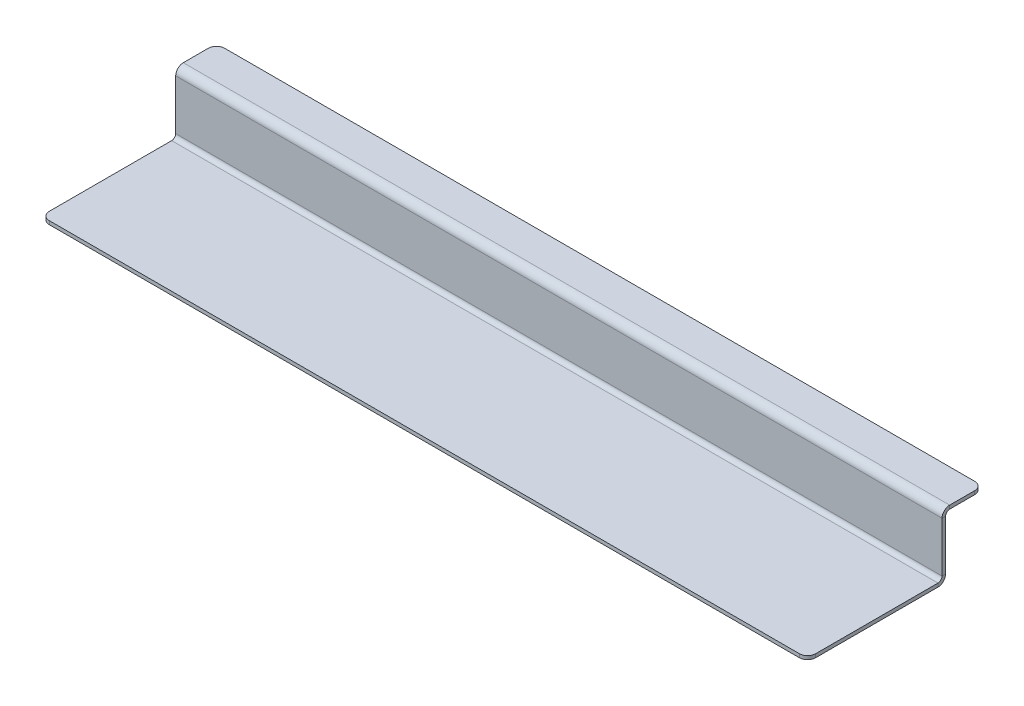
ISO-10303-21;
HEADER;
FILE_DESCRIPTION(('STEP AP214'),'2;1');
FILE_NAME('part.step','',(''),(''),'','','');
FILE_SCHEMA(('AUTOMOTIVE_DESIGN { 1 0 10303 214 1 1 1 1 }'));
ENDSEC;
DATA;
#1=APPLICATION_CONTEXT('core data for automotive mechanical design processes');
#2=APPLICATION_PROTOCOL_DEFINITION('international standard','automotive_design',2000,#1);
#3=PRODUCT_CONTEXT('',#1,'mechanical');
#4=PRODUCT('Part','Part','',(#3));
#5=PRODUCT_RELATED_PRODUCT_CATEGORY('part','',(#4));
#6=PRODUCT_DEFINITION_FORMATION('','',#4);
#7=PRODUCT_DEFINITION_CONTEXT('part definition',#1,'design');
#8=PRODUCT_DEFINITION('design','',#6,#7);
#9=PRODUCT_DEFINITION_SHAPE('','',#8);
#10=(LENGTH_UNIT() NAMED_UNIT(*) SI_UNIT(.MILLI.,.METRE.));
#11=(NAMED_UNIT(*) PLANE_ANGLE_UNIT() SI_UNIT($,.RADIAN.));
#12=(NAMED_UNIT(*) SI_UNIT($,.STERADIAN.) SOLID_ANGLE_UNIT());
#13=UNCERTAINTY_MEASURE_WITH_UNIT(LENGTH_MEASURE(1.E-05),#10,'distance_accuracy_value','');
#14=(GEOMETRIC_REPRESENTATION_CONTEXT(3) GLOBAL_UNCERTAINTY_ASSIGNED_CONTEXT((#13)) GLOBAL_UNIT_ASSIGNED_CONTEXT((#10,
#11,#12)) REPRESENTATION_CONTEXT('',''));
#15=CARTESIAN_POINT('',(0.,0.,0.));
#16=DIRECTION('',(0.,0.,1.));
#17=DIRECTION('',(1.,0.,0.));
#18=AXIS2_PLACEMENT_3D('',#15,#16,#17);
#19=CARTESIAN_POINT('',(596.9,-50.8,31.7500000000002));
#20=DIRECTION('',(-1.,0.,0.));
#21=DIRECTION('',(0.,0.,-1.));
#22=AXIS2_PLACEMENT_3D('',#19,#20,#21);
#23=PLANE('',#22);
#24=DIRECTION('',(0.,0.,-1.));
#25=VECTOR('',#24,1.);
#26=CARTESIAN_POINT('',(596.9,-44.87164,31.7500000000001));
#27=LINE('',#26,#25);
#28=CARTESIAN_POINT('',(596.9,-44.87164,31.7500000000001));
#29=VERTEX_POINT('',#28);
#30=CARTESIAN_POINT('',(596.9,-44.87164,28.9966400000001));
#31=VERTEX_POINT('',#30);
#32=EDGE_CURVE('E202',#29,#31,#27,.T.);
#33=ORIENTED_EDGE('',*,*,#32,.T.);
#34=DIRECTION('',(0.,1.,0.));
#35=VECTOR('',#34,1.);
#36=CARTESIAN_POINT('',(596.9,-50.8,28.9966400000002));
#37=LINE('',#36,#35);
#38=CARTESIAN_POINT('',(596.9,-5.92836000000005,28.99664));
#39=VERTEX_POINT('',#38);
#40=EDGE_CURVE('E217',#39,#31,#37,.F.);
#41=ORIENTED_EDGE('',*,*,#40,.F.);
#42=DIRECTION('',(0.,0.,-1.));
#43=VECTOR('',#42,1.);
#44=CARTESIAN_POINT('',(596.9,-5.92836000000001,28.99664));
#45=LINE('',#44,#43);
#46=CARTESIAN_POINT('',(596.9,-5.92835999999999,31.75));
#47=VERTEX_POINT('',#46);
#48=EDGE_CURVE('E223',#39,#47,#45,.F.);
#49=ORIENTED_EDGE('',*,*,#48,.T.);
#50=DIRECTION('',(0.,-1.,0.));
#51=VECTOR('',#50,1.);
#52=CARTESIAN_POINT('',(596.9,1.19661315799875E-13,31.75));
#53=LINE('',#52,#51);
#54=EDGE_CURVE('E211',#47,#29,#53,.T.);
#55=ORIENTED_EDGE('',*,*,#54,.T.);
#56=EDGE_LOOP('',(#33,#41,#49,#55));
#57=FACE_BOUND('',#56,.T.);
#58=ADVANCED_FACE('F41',(#57),#23,.F.);
#59=CARTESIAN_POINT('',(0.,-2.75335999999999,31.75));
#60=DIRECTION('',(1.,0.,0.));
#61=DIRECTION('',(0.,0.,1.));
#62=AXIS2_PLACEMENT_3D('',#59,#60,#61);
#63=PLANE('',#62);
#64=DIRECTION('',(0.,0.,-1.));
#65=VECTOR('',#64,1.);
#66=CARTESIAN_POINT('',(0.,-44.87164,31.7500000000001));
#67=LINE('',#66,#65);
#68=CARTESIAN_POINT('',(0.,-44.87164,31.7500000000001));
#69=VERTEX_POINT('',#68);
#70=CARTESIAN_POINT('',(0.,-44.87164,28.9966400000001));
#71=VERTEX_POINT('',#70);
#72=EDGE_CURVE('E188',#69,#71,#67,.T.);
#73=ORIENTED_EDGE('',*,*,#72,.F.);
#74=DIRECTION('',(0.,1.,0.));
#75=VECTOR('',#74,1.);
#76=CARTESIAN_POINT('',(0.,1.19661315799875E-13,31.75));
#77=LINE('',#76,#75);
#78=CARTESIAN_POINT('',(0.,-5.92835999999996,31.75));
#79=VERTEX_POINT('',#78);
#80=EDGE_CURVE('E207',#69,#79,#77,.T.);
#81=ORIENTED_EDGE('',*,*,#80,.T.);
#82=DIRECTION('',(0.,0.,-1.));
#83=VECTOR('',#82,1.);
#84=CARTESIAN_POINT('',(0.,-5.92835999999997,31.75));
#85=LINE('',#84,#83);
#86=CARTESIAN_POINT('',(0.,-5.92835999999997,28.99664));
#87=VERTEX_POINT('',#86);
#88=EDGE_CURVE('E205',#87,#79,#85,.F.);
#89=ORIENTED_EDGE('',*,*,#88,.F.);
#90=DIRECTION('',(0.,-1.,0.));
#91=VECTOR('',#90,1.);
#92=CARTESIAN_POINT('',(0.,-2.75336,28.99664));
#93=LINE('',#92,#91);
#94=EDGE_CURVE('E214',#71,#87,#93,.F.);
#95=ORIENTED_EDGE('',*,*,#94,.F.);
#96=EDGE_LOOP('',(#73,#81,#89,#95));
#97=FACE_BOUND('',#96,.T.);
#98=ADVANCED_FACE('F338',(#97),#63,.F.);
#99=CARTESIAN_POINT('',(0.,1.19661315799875E-13,31.75));
#100=DIRECTION('',(0.,0.,-1.));
#101=DIRECTION('',(0.,-1.,0.));
#102=AXIS2_PLACEMENT_3D('',#99,#100,#101);
#103=PLANE('',#102);
#104=DIRECTION('',(-1.,0.,0.));
#105=VECTOR('',#104,1.);
#106=CARTESIAN_POINT('',(0.,-44.87164,31.7500000000001));
#107=LINE('',#106,#105);
#108=EDGE_CURVE('E194',#69,#29,#107,.F.);
#109=ORIENTED_EDGE('',*,*,#108,.T.);
#110=ORIENTED_EDGE('',*,*,#54,.F.);
#111=DIRECTION('',(1.,0.,0.));
#112=VECTOR('',#111,1.);
#113=CARTESIAN_POINT('',(0.,-5.92835999999997,31.75));
#114=LINE('',#113,#112);
#115=EDGE_CURVE('E220',#47,#79,#114,.F.);
#116=ORIENTED_EDGE('',*,*,#115,.T.);
#117=ORIENTED_EDGE('',*,*,#80,.F.);
#118=EDGE_LOOP('',(#109,#110,#116,#117));
#119=FACE_BOUND('',#118,.T.);
#120=ADVANCED_FACE('F333',(#119),#103,.F.);
#121=CARTESIAN_POINT('',(0.,1.10048010740757E-13,28.99664));
#122=DIRECTION('',(0.,0.,-1.));
#123=DIRECTION('',(0.,-1.,0.));
#124=AXIS2_PLACEMENT_3D('',#121,#122,#123);
#125=PLANE('',#124);
#126=ORIENTED_EDGE('',*,*,#94,.T.);
#127=DIRECTION('',(1.,0.,0.));
#128=VECTOR('',#127,1.);
#129=CARTESIAN_POINT('',(0.,-5.92835999999999,28.99664));
#130=LINE('',#129,#128);
#131=EDGE_CURVE('E226',#87,#39,#130,.T.);
#132=ORIENTED_EDGE('',*,*,#131,.T.);
#133=ORIENTED_EDGE('',*,*,#40,.T.);
#134=DIRECTION('',(-1.,0.,0.));
#135=VECTOR('',#134,1.);
#136=CARTESIAN_POINT('',(0.,-44.87164,28.9966400000001));
#137=LINE('',#136,#135);
#138=EDGE_CURVE('E189',#71,#31,#137,.F.);
#139=ORIENTED_EDGE('',*,*,#138,.F.);
#140=EDGE_LOOP('',(#126,#132,#133,#139));
#141=FACE_BOUND('',#140,.T.);
#142=ADVANCED_FACE('F340',(#141),#125,.T.);
#143=CARTESIAN_POINT('',(596.9,-2.75336,0.));
#144=DIRECTION('',(1.,0.,0.));
#145=DIRECTION('',(0.,0.,1.));
#146=AXIS2_PLACEMENT_3D('',#143,#144,#145);
#147=PLANE('',#146);
#148=DIRECTION('',(0.,0.,1.));
#149=VECTOR('',#148,1.);
#150=CARTESIAN_POINT('',(596.9,0.,0.));
#151=LINE('',#150,#149);
#152=CARTESIAN_POINT('',(596.9,0.,6.35));
#153=VERTEX_POINT('',#152);
#154=CARTESIAN_POINT('',(596.9,0.,25.82164));
#155=VERTEX_POINT('',#154);
#156=EDGE_CURVE('E255',#153,#155,#151,.T.);
#157=ORIENTED_EDGE('',*,*,#156,.T.);
#158=DIRECTION('',(0.,1.,0.));
#159=VECTOR('',#158,1.);
#160=CARTESIAN_POINT('',(596.9,-2.75336000000006,25.82164));
#161=LINE('',#160,#159);
#162=CARTESIAN_POINT('',(596.9,-2.75336,25.82164));
#163=VERTEX_POINT('',#162);
#164=EDGE_CURVE('E237',#163,#155,#161,.T.);
#165=ORIENTED_EDGE('',*,*,#164,.F.);
#166=DIRECTION('',(0.,0.,1.));
#167=VECTOR('',#166,1.);
#168=CARTESIAN_POINT('',(596.9,-2.75336,0.));
#169=LINE('',#168,#167);
#170=CARTESIAN_POINT('',(596.9,-2.75336,6.35));
#171=VERTEX_POINT('',#170);
#172=EDGE_CURVE('E258',#171,#163,#169,.T.);
#173=ORIENTED_EDGE('',*,*,#172,.F.);
#174=DIRECTION('',(0.,1.,0.));
#175=VECTOR('',#174,1.);
#176=CARTESIAN_POINT('',(596.9,-2.75336,6.35));
#177=LINE('',#176,#175);
#178=EDGE_CURVE('E277',#153,#171,#177,.F.);
#179=ORIENTED_EDGE('',*,*,#178,.F.);
#180=EDGE_LOOP('',(#157,#165,#173,#179));
#181=FACE_BOUND('',#180,.T.);
#182=ADVANCED_FACE('F384',(#181),#147,.T.);
#183=CARTESIAN_POINT('',(0.,-2.75336,0.));
#184=DIRECTION('',(0.,-1.,0.));
#185=DIRECTION('',(0.,0.,1.));
#186=AXIS2_PLACEMENT_3D('',#183,#184,#185);
#187=PLANE('',#186);
#188=ORIENTED_EDGE('',*,*,#172,.T.);
#189=DIRECTION('',(1.,0.,0.));
#190=VECTOR('',#189,1.);
#191=CARTESIAN_POINT('',(596.9,-2.75336000000006,25.82164));
#192=LINE('',#191,#190);
#193=CARTESIAN_POINT('',(0.,-2.75336,25.82164));
#194=VERTEX_POINT('',#193);
#195=EDGE_CURVE('E241',#163,#194,#192,.F.);
#196=ORIENTED_EDGE('',*,*,#195,.T.);
#197=DIRECTION('',(0.,0.,-1.));
#198=VECTOR('',#197,1.);
#199=CARTESIAN_POINT('',(0.,-2.75336,0.));
#200=LINE('',#199,#198);
#201=CARTESIAN_POINT('',(0.,-2.75336,6.35));
#202=VERTEX_POINT('',#201);
#203=EDGE_CURVE('E251',#194,#202,#200,.T.);
#204=ORIENTED_EDGE('',*,*,#203,.T.);
#205=CARTESIAN_POINT('',(6.35,-2.75336,6.35));
#206=DIRECTION('',(0.,1.,0.));
#207=DIRECTION('',(0.,0.,1.));
#208=AXIS2_PLACEMENT_3D('',#205,#206,#207);
#209=CIRCLE('',#208,6.35);
#210=CARTESIAN_POINT('',(6.35,-2.75336,0.));
#211=VERTEX_POINT('',#210);
#212=EDGE_CURVE('E280',#211,#202,#209,.T.);
#213=ORIENTED_EDGE('',*,*,#212,.F.);
#214=DIRECTION('',(1.,0.,0.));
#215=VECTOR('',#214,1.);
#216=CARTESIAN_POINT('',(0.,-2.75336,0.));
#217=LINE('',#216,#215);
#218=CARTESIAN_POINT('',(590.55,-2.75336,0.));
#219=VERTEX_POINT('',#218);
#220=EDGE_CURVE('E254',#211,#219,#217,.T.);
#221=ORIENTED_EDGE('',*,*,#220,.T.);
#222=CARTESIAN_POINT('',(590.55,-2.75336,6.35));
#223=DIRECTION('',(0.,1.,0.));
#224=DIRECTION('',(0.,0.,1.));
#225=AXIS2_PLACEMENT_3D('',#222,#223,#224);
#226=CIRCLE('',#225,6.35);
#227=EDGE_CURVE('E283',#171,#219,#226,.T.);
#228=ORIENTED_EDGE('',*,*,#227,.F.);
#229=EDGE_LOOP('',(#188,#196,#204,#213,#221,#228));
#230=FACE_BOUND('',#229,.T.);
#231=ADVANCED_FACE('F362',(#230),#187,.T.);
#232=CARTESIAN_POINT('',(0.,0.,0.));
#233=DIRECTION('',(0.,-1.,0.));
#234=DIRECTION('',(0.,0.,1.));
#235=AXIS2_PLACEMENT_3D('',#232,#233,#234);
#236=PLANE('',#235);
#237=DIRECTION('',(1.,0.,0.));
#238=VECTOR('',#237,1.);
#239=CARTESIAN_POINT('',(0.,0.,0.));
#240=LINE('',#239,#238);
#241=CARTESIAN_POINT('',(6.35,0.,0.));
#242=VERTEX_POINT('',#241);
#243=CARTESIAN_POINT('',(590.55,0.,0.));
#244=VERTEX_POINT('',#243);
#245=EDGE_CURVE('E264',#242,#244,#240,.T.);
#246=ORIENTED_EDGE('',*,*,#245,.F.);
#247=CARTESIAN_POINT('',(6.35,0.,6.35));
#248=DIRECTION('',(0.,1.,0.));
#249=DIRECTION('',(0.,0.,1.));
#250=AXIS2_PLACEMENT_3D('',#247,#248,#249);
#251=CIRCLE('',#250,6.35);
#252=CARTESIAN_POINT('',(0.,0.,6.35));
#253=VERTEX_POINT('',#252);
#254=EDGE_CURVE('E272',#253,#242,#251,.F.);
#255=ORIENTED_EDGE('',*,*,#254,.F.);
#256=DIRECTION('',(0.,0.,-1.));
#257=VECTOR('',#256,1.);
#258=CARTESIAN_POINT('',(0.,0.,0.));
#259=LINE('',#258,#257);
#260=CARTESIAN_POINT('',(0.,0.,25.82164));
#261=VERTEX_POINT('',#260);
#262=EDGE_CURVE('E248',#261,#253,#259,.T.);
#263=ORIENTED_EDGE('',*,*,#262,.F.);
#264=DIRECTION('',(1.,0.,0.));
#265=VECTOR('',#264,1.);
#266=CARTESIAN_POINT('',(596.9,0.,25.82164));
#267=LINE('',#266,#265);
#268=EDGE_CURVE('E231',#155,#261,#267,.F.);
#269=ORIENTED_EDGE('',*,*,#268,.F.);
#270=ORIENTED_EDGE('',*,*,#156,.F.);
#271=CARTESIAN_POINT('',(590.55,0.,6.35));
#272=DIRECTION('',(0.,1.,0.));
#273=DIRECTION('',(0.,0.,1.));
#274=AXIS2_PLACEMENT_3D('',#271,#272,#273);
#275=CIRCLE('',#274,6.35);
#276=EDGE_CURVE('E275',#244,#153,#275,.F.);
#277=ORIENTED_EDGE('',*,*,#276,.F.);
#278=EDGE_LOOP('',(#246,#255,#263,#269,#270,#277));
#279=FACE_BOUND('',#278,.T.);
#280=ADVANCED_FACE('F561',(#279),#236,.F.);
#281=CARTESIAN_POINT('',(0.,-2.75336,0.));
#282=DIRECTION('',(-1.,0.,0.));
#283=DIRECTION('',(0.,0.,-1.));
#284=AXIS2_PLACEMENT_3D('',#281,#282,#283);
#285=PLANE('',#284);
#286=ORIENTED_EDGE('',*,*,#203,.F.);
#287=DIRECTION('',(0.,1.,0.));
#288=VECTOR('',#287,1.);
#289=CARTESIAN_POINT('',(0.,-2.75335999999998,25.82164));
#290=LINE('',#289,#288);
#291=EDGE_CURVE('E245',#194,#261,#290,.T.);
#292=ORIENTED_EDGE('',*,*,#291,.T.);
#293=ORIENTED_EDGE('',*,*,#262,.T.);
#294=DIRECTION('',(0.,1.,0.));
#295=VECTOR('',#294,1.);
#296=CARTESIAN_POINT('',(0.,-2.75336,6.35));
#297=LINE('',#296,#295);
#298=EDGE_CURVE('E11',#202,#253,#297,.T.);
#299=ORIENTED_EDGE('',*,*,#298,.F.);
#300=EDGE_LOOP('',(#286,#292,#293,#299));
#301=FACE_BOUND('',#300,.T.);
#302=ADVANCED_FACE('F358',(#301),#285,.T.);
#303=CARTESIAN_POINT('',(0.,-2.75336,0.));
#304=DIRECTION('',(0.,0.,-1.));
#305=DIRECTION('',(1.,0.,0.));
#306=AXIS2_PLACEMENT_3D('',#303,#304,#305);
#307=PLANE('',#306);
#308=ORIENTED_EDGE('',*,*,#220,.F.);
#309=DIRECTION('',(0.,1.,0.));
#310=VECTOR('',#309,1.);
#311=CARTESIAN_POINT('',(6.35,-2.75336,0.));
#312=LINE('',#311,#310);
#313=EDGE_CURVE('E261',#242,#211,#312,.F.);
#314=ORIENTED_EDGE('',*,*,#313,.F.);
#315=ORIENTED_EDGE('',*,*,#245,.T.);
#316=DIRECTION('',(0.,1.,0.));
#317=VECTOR('',#316,1.);
#318=CARTESIAN_POINT('',(590.55,-2.75336,0.));
#319=LINE('',#318,#317);
#320=EDGE_CURVE('E270',#219,#244,#319,.T.);
#321=ORIENTED_EDGE('',*,*,#320,.F.);
#322=EDGE_LOOP('',(#308,#314,#315,#321));
#323=FACE_BOUND('',#322,.T.);
#324=ADVANCED_FACE('F543',(#323),#307,.T.);
#325=CARTESIAN_POINT('',(0.,-5.92835999999998,25.82164));
#326=DIRECTION('',(-1.,0.,0.));
#327=DIRECTION('',(0.,-1.,0.));
#328=AXIS2_PLACEMENT_3D('',#325,#326,#327);
#329=PLANE('',#328);
#330=ORIENTED_EDGE('',*,*,#88,.T.);
#331=CARTESIAN_POINT('',(0.,-5.92835999999998,25.82164));
#332=DIRECTION('',(-1.,0.,0.));
#333=DIRECTION('',(0.,1.,0.));
#334=AXIS2_PLACEMENT_3D('',#331,#332,#333);
#335=CIRCLE('',#334,5.92836);
#336=EDGE_CURVE('E234',#261,#79,#335,.F.);
#337=ORIENTED_EDGE('',*,*,#336,.F.);
#338=ORIENTED_EDGE('',*,*,#291,.F.);
#339=CARTESIAN_POINT('',(0.,-5.92835999999998,25.82164));
#340=DIRECTION('',(-1.,0.,0.));
#341=DIRECTION('',(0.,1.,0.));
#342=AXIS2_PLACEMENT_3D('',#339,#340,#341);
#343=CIRCLE('',#342,3.175);
#344=EDGE_CURVE('E239',#194,#87,#343,.F.);
#345=ORIENTED_EDGE('',*,*,#344,.T.);
#346=EDGE_LOOP('',(#330,#337,#338,#345));
#347=FACE_BOUND('',#346,.T.);
#348=ADVANCED_FACE('F355',(#347),#329,.T.);
#349=CARTESIAN_POINT('',(596.9,-5.92836000000006,25.82164));
#350=DIRECTION('',(-1.,0.,0.));
#351=DIRECTION('',(0.,-1.,0.));
#352=AXIS2_PLACEMENT_3D('',#349,#350,#351);
#353=PLANE('',#352);
#354=CARTESIAN_POINT('',(596.9,-5.92836000000006,25.82164));
#355=DIRECTION('',(-1.,0.,0.));
#356=DIRECTION('',(0.,1.,0.));
#357=AXIS2_PLACEMENT_3D('',#354,#355,#356);
#358=CIRCLE('',#357,3.175);
#359=EDGE_CURVE('E210',#39,#163,#358,.T.);
#360=ORIENTED_EDGE('',*,*,#359,.T.);
#361=ORIENTED_EDGE('',*,*,#164,.T.);
#362=CARTESIAN_POINT('',(596.9,-5.92836000000006,25.82164));
#363=DIRECTION('',(-1.,0.,0.));
#364=DIRECTION('',(0.,1.,0.));
#365=AXIS2_PLACEMENT_3D('',#362,#363,#364);
#366=CIRCLE('',#365,5.92836);
#367=EDGE_CURVE('E235',#47,#155,#366,.T.);
#368=ORIENTED_EDGE('',*,*,#367,.F.);
#369=ORIENTED_EDGE('',*,*,#48,.F.);
#370=EDGE_LOOP('',(#360,#361,#368,#369));
#371=FACE_BOUND('',#370,.T.);
#372=ADVANCED_FACE('F346',(#371),#353,.F.);
#373=CARTESIAN_POINT('',(596.9,-5.92836000000006,25.82164));
#374=DIRECTION('',(1.,0.,0.));
#375=DIRECTION('',(0.,0.,1.));
#376=AXIS2_PLACEMENT_3D('',#373,#374,#375);
#377=CYLINDRICAL_SURFACE('',#376,5.92836);
#378=ORIENTED_EDGE('',*,*,#268,.T.);
#379=ORIENTED_EDGE('',*,*,#336,.T.);
#380=ORIENTED_EDGE('',*,*,#115,.F.);
#381=ORIENTED_EDGE('',*,*,#367,.T.);
#382=EDGE_LOOP('',(#378,#379,#380,#381));
#383=FACE_BOUND('',#382,.T.);
#384=ADVANCED_FACE('F351',(#383),#377,.T.);
#385=CARTESIAN_POINT('',(596.9,-5.92836000000006,25.82164));
#386=DIRECTION('',(1.,0.,0.));
#387=DIRECTION('',(0.,0.,1.));
#388=AXIS2_PLACEMENT_3D('',#385,#386,#387);
#389=CYLINDRICAL_SURFACE('',#388,3.175);
#390=ORIENTED_EDGE('',*,*,#195,.F.);
#391=ORIENTED_EDGE('',*,*,#359,.F.);
#392=ORIENTED_EDGE('',*,*,#131,.F.);
#393=ORIENTED_EDGE('',*,*,#344,.F.);
#394=EDGE_LOOP('',(#390,#391,#392,#393));
#395=FACE_BOUND('',#394,.T.);
#396=ADVANCED_FACE('F365',(#395),#389,.F.);
#397=CARTESIAN_POINT('',(596.9,-44.87164,34.9250000000002));
#398=DIRECTION('',(1.,0.,0.));
#399=DIRECTION('',(0.,0.,1.));
#400=AXIS2_PLACEMENT_3D('',#397,#398,#399);
#401=PLANE('',#400);
#402=DIRECTION('',(0.,1.,0.));
#403=VECTOR('',#402,1.);
#404=CARTESIAN_POINT('',(596.9,-50.8,34.9250000000002));
#405=LINE('',#404,#403);
#406=CARTESIAN_POINT('',(596.9,-48.04664,34.9250000000002));
#407=VERTEX_POINT('',#406);
#408=CARTESIAN_POINT('',(596.9,-50.8,34.9250000000002));
#409=VERTEX_POINT('',#408);
#410=EDGE_CURVE('E312',#407,#409,#405,.F.);
#411=ORIENTED_EDGE('',*,*,#410,.T.);
#412=CARTESIAN_POINT('',(596.9,-44.87164,34.9250000000002));
#413=DIRECTION('',(1.,0.,0.));
#414=DIRECTION('',(0.,0.,-1.));
#415=AXIS2_PLACEMENT_3D('',#412,#413,#414);
#416=CIRCLE('',#415,5.92836);
#417=EDGE_CURVE('E171',#31,#409,#416,.F.);
#418=ORIENTED_EDGE('',*,*,#417,.F.);
#419=ORIENTED_EDGE('',*,*,#32,.F.);
#420=CARTESIAN_POINT('',(596.9,-44.87164,34.9250000000002));
#421=DIRECTION('',(1.,0.,0.));
#422=DIRECTION('',(0.,0.,-1.));
#423=AXIS2_PLACEMENT_3D('',#420,#421,#422);
#424=CIRCLE('',#423,3.175);
#425=EDGE_CURVE('E190',#29,#407,#424,.F.);
#426=ORIENTED_EDGE('',*,*,#425,.T.);
#427=EDGE_LOOP('',(#411,#418,#419,#426));
#428=FACE_BOUND('',#427,.T.);
#429=ADVANCED_FACE('F315',(#428),#401,.T.);
#430=CARTESIAN_POINT('',(0.,-44.87164,34.9250000000002));
#431=DIRECTION('',(1.,0.,0.));
#432=DIRECTION('',(0.,0.,1.));
#433=AXIS2_PLACEMENT_3D('',#430,#431,#432);
#434=PLANE('',#433);
#435=CARTESIAN_POINT('',(0.,-44.87164,34.9250000000002));
#436=DIRECTION('',(1.,0.,0.));
#437=DIRECTION('',(0.,0.,-1.));
#438=AXIS2_PLACEMENT_3D('',#435,#436,#437);
#439=CIRCLE('',#438,3.175);
#440=CARTESIAN_POINT('',(0.,-48.04664,34.9250000000002));
#441=VERTEX_POINT('',#440);
#442=EDGE_CURVE('E200',#441,#69,#439,.T.);
#443=ORIENTED_EDGE('',*,*,#442,.T.);
#444=ORIENTED_EDGE('',*,*,#72,.T.);
#445=CARTESIAN_POINT('',(0.,-44.87164,34.9250000000002));
#446=DIRECTION('',(1.,0.,0.));
#447=DIRECTION('',(0.,0.,-1.));
#448=AXIS2_PLACEMENT_3D('',#445,#446,#447);
#449=CIRCLE('',#448,5.92836);
#450=CARTESIAN_POINT('',(0.,-50.8,34.9250000000001));
#451=VERTEX_POINT('',#450);
#452=EDGE_CURVE('E169',#451,#71,#449,.T.);
#453=ORIENTED_EDGE('',*,*,#452,.F.);
#454=DIRECTION('',(0.,1.,0.));
#455=VECTOR('',#454,1.);
#456=CARTESIAN_POINT('',(0.,-48.04664,34.9250000000001));
#457=LINE('',#456,#455);
#458=EDGE_CURVE('E174',#441,#451,#457,.F.);
#459=ORIENTED_EDGE('',*,*,#458,.F.);
#460=EDGE_LOOP('',(#443,#444,#453,#459));
#461=FACE_BOUND('',#460,.T.);
#462=ADVANCED_FACE('F186',(#461),#434,.F.);
#463=CARTESIAN_POINT('',(0.,-44.87164,34.9250000000002));
#464=DIRECTION('',(-1.,0.,0.));
#465=DIRECTION('',(0.,-1.,0.));
#466=AXIS2_PLACEMENT_3D('',#463,#464,#465);
#467=CYLINDRICAL_SURFACE('',#466,5.92836);
#468=ORIENTED_EDGE('',*,*,#138,.T.);
#469=ORIENTED_EDGE('',*,*,#417,.T.);
#470=DIRECTION('',(-1.,0.,0.));
#471=VECTOR('',#470,1.);
#472=CARTESIAN_POINT('',(596.9,-50.8,34.9250000000002));
#473=LINE('',#472,#471);
#474=EDGE_CURVE('E157',#451,#409,#473,.F.);
#475=ORIENTED_EDGE('',*,*,#474,.F.);
#476=ORIENTED_EDGE('',*,*,#452,.T.);
#477=EDGE_LOOP('',(#468,#469,#475,#476));
#478=FACE_BOUND('',#477,.T.);
#479=ADVANCED_FACE('F167',(#478),#467,.T.);
#480=CARTESIAN_POINT('',(0.,-44.87164,34.9250000000002));
#481=DIRECTION('',(-1.,0.,0.));
#482=DIRECTION('',(0.,-1.,0.));
#483=AXIS2_PLACEMENT_3D('',#480,#481,#482);
#484=CYLINDRICAL_SURFACE('',#483,3.175);
#485=ORIENTED_EDGE('',*,*,#108,.F.);
#486=ORIENTED_EDGE('',*,*,#442,.F.);
#487=DIRECTION('',(-1.,0.,0.));
#488=VECTOR('',#487,1.);
#489=CARTESIAN_POINT('',(596.9,-48.04664,34.9250000000002));
#490=LINE('',#489,#488);
#491=EDGE_CURVE('E183',#407,#441,#490,.T.);
#492=ORIENTED_EDGE('',*,*,#491,.F.);
#493=ORIENTED_EDGE('',*,*,#425,.F.);
#494=EDGE_LOOP('',(#485,#486,#492,#493));
#495=FACE_BOUND('',#494,.T.);
#496=ADVANCED_FACE('F329',(#495),#484,.F.);
#497=CARTESIAN_POINT('',(596.9,-50.8,31.7500000000002));
#498=DIRECTION('',(-1.,0.,0.));
#499=DIRECTION('',(0.,0.,-1.));
#500=AXIS2_PLACEMENT_3D('',#497,#498,#499);
#501=PLANE('',#500);
#502=DIRECTION('',(0.,0.,-1.));
#503=VECTOR('',#502,1.);
#504=CARTESIAN_POINT('',(596.9,-50.8,0.));
#505=LINE('',#504,#503);
#506=CARTESIAN_POINT('',(596.9,-50.8,130.175));
#507=VERTEX_POINT('',#506);
#508=EDGE_CURVE('E163',#507,#409,#505,.T.);
#509=ORIENTED_EDGE('',*,*,#508,.T.);
#510=ORIENTED_EDGE('',*,*,#410,.F.);
#511=DIRECTION('',(0.,0.,1.));
#512=VECTOR('',#511,1.);
#513=CARTESIAN_POINT('',(596.9,-48.04664,31.7500000000002));
#514=LINE('',#513,#512);
#515=CARTESIAN_POINT('',(596.9,-48.04664,130.175));
#516=VERTEX_POINT('',#515);
#517=EDGE_CURVE('E173',#516,#407,#514,.F.);
#518=ORIENTED_EDGE('',*,*,#517,.F.);
#519=DIRECTION('',(0.,1.,0.));
#520=VECTOR('',#519,1.);
#521=CARTESIAN_POINT('',(596.9,-50.8,130.175));
#522=LINE('',#521,#520);
#523=EDGE_CURVE('E286',#507,#516,#522,.T.);
#524=ORIENTED_EDGE('',*,*,#523,.F.);
#525=EDGE_LOOP('',(#509,#510,#518,#524));
#526=FACE_BOUND('',#525,.T.);
#527=ADVANCED_FACE('F319',(#526),#501,.F.);
#528=CARTESIAN_POINT('',(0.,-50.8,136.525));
#529=DIRECTION('',(1.,0.,0.));
#530=DIRECTION('',(0.,0.,1.));
#531=AXIS2_PLACEMENT_3D('',#528,#529,#530);
#532=PLANE('',#531);
#533=DIRECTION('',(0.,0.,-1.));
#534=VECTOR('',#533,1.);
#535=CARTESIAN_POINT('',(0.,-48.04664,136.525));
#536=LINE('',#535,#534);
#537=CARTESIAN_POINT('',(0.,-48.04664,130.175));
#538=VERTEX_POINT('',#537);
#539=EDGE_CURVE('E179',#441,#538,#536,.F.);
#540=ORIENTED_EDGE('',*,*,#539,.F.);
#541=ORIENTED_EDGE('',*,*,#458,.T.);
#542=DIRECTION('',(0.,0.,1.));
#543=VECTOR('',#542,1.);
#544=CARTESIAN_POINT('',(0.,-50.8,0.));
#545=LINE('',#544,#543);
#546=CARTESIAN_POINT('',(0.,-50.8,130.175));
#547=VERTEX_POINT('',#546);
#548=EDGE_CURVE('E153',#451,#547,#545,.T.);
#549=ORIENTED_EDGE('',*,*,#548,.T.);
#550=DIRECTION('',(0.,1.,0.));
#551=VECTOR('',#550,1.);
#552=CARTESIAN_POINT('',(0.,-50.8,130.175));
#553=LINE('',#552,#551);
#554=EDGE_CURVE('E49',#538,#547,#553,.F.);
#555=ORIENTED_EDGE('',*,*,#554,.F.);
#556=EDGE_LOOP('',(#540,#541,#549,#555));
#557=FACE_BOUND('',#556,.T.);
#558=ADVANCED_FACE('F177',(#557),#532,.F.);
#559=CARTESIAN_POINT('',(0.,-50.8,0.));
#560=DIRECTION('',(0.,1.,0.));
#561=DIRECTION('',(0.,0.,-1.));
#562=AXIS2_PLACEMENT_3D('',#559,#560,#561);
#563=PLANE('',#562);
#564=DIRECTION('',(1.,0.,0.));
#565=VECTOR('',#564,1.);
#566=CARTESIAN_POINT('',(0.,-50.8,136.525));
#567=LINE('',#566,#565);
#568=CARTESIAN_POINT('',(6.34999999999997,-50.8,136.525));
#569=VERTEX_POINT('',#568);
#570=CARTESIAN_POINT('',(590.55,-50.8,136.525));
#571=VERTEX_POINT('',#570);
#572=EDGE_CURVE('E162',#569,#571,#567,.T.);
#573=ORIENTED_EDGE('',*,*,#572,.F.);
#574=CARTESIAN_POINT('',(6.34999999999997,-50.8,130.175));
#575=DIRECTION('',(0.,-1.,0.));
#576=DIRECTION('',(0.,0.,-1.));
#577=AXIS2_PLACEMENT_3D('',#574,#575,#576);
#578=CIRCLE('',#577,6.35);
#579=EDGE_CURVE('E56',#547,#569,#578,.F.);
#580=ORIENTED_EDGE('',*,*,#579,.F.);
#581=ORIENTED_EDGE('',*,*,#548,.F.);
#582=ORIENTED_EDGE('',*,*,#474,.T.);
#583=ORIENTED_EDGE('',*,*,#508,.F.);
#584=CARTESIAN_POINT('',(590.55,-50.8,130.175));
#585=DIRECTION('',(0.,-1.,0.));
#586=DIRECTION('',(0.,0.,-1.));
#587=AXIS2_PLACEMENT_3D('',#584,#585,#586);
#588=CIRCLE('',#587,6.35);
#589=EDGE_CURVE('E297',#571,#507,#588,.F.);
#590=ORIENTED_EDGE('',*,*,#589,.F.);
#591=EDGE_LOOP('',(#573,#580,#581,#582,#583,#590));
#592=FACE_BOUND('',#591,.T.);
#593=ADVANCED_FACE('F155',(#592),#563,.F.);
#594=CARTESIAN_POINT('',(0.,-48.04664,0.));
#595=DIRECTION('',(0.,1.,0.));
#596=DIRECTION('',(0.,0.,-1.));
#597=AXIS2_PLACEMENT_3D('',#594,#595,#596);
#598=PLANE('',#597);
#599=ORIENTED_EDGE('',*,*,#517,.T.);
#600=ORIENTED_EDGE('',*,*,#491,.T.);
#601=ORIENTED_EDGE('',*,*,#539,.T.);
#602=CARTESIAN_POINT('',(6.34999999999997,-48.04664,130.175));
#603=DIRECTION('',(0.,-1.,0.));
#604=DIRECTION('',(0.,0.,-1.));
#605=AXIS2_PLACEMENT_3D('',#602,#603,#604);
#606=CIRCLE('',#605,6.35);
#607=CARTESIAN_POINT('',(6.34999999999997,-48.04664,136.525));
#608=VERTEX_POINT('',#607);
#609=EDGE_CURVE('E289',#608,#538,#606,.T.);
#610=ORIENTED_EDGE('',*,*,#609,.F.);
#611=DIRECTION('',(-1.,0.,0.));
#612=VECTOR('',#611,1.);
#613=CARTESIAN_POINT('',(596.9,-48.04664,136.525));
#614=LINE('',#613,#612);
#615=CARTESIAN_POINT('',(590.55,-48.04664,136.525));
#616=VERTEX_POINT('',#615);
#617=EDGE_CURVE('E305',#608,#616,#614,.F.);
#618=ORIENTED_EDGE('',*,*,#617,.T.);
#619=CARTESIAN_POINT('',(590.55,-48.04664,130.175));
#620=DIRECTION('',(0.,-1.,0.));
#621=DIRECTION('',(0.,0.,-1.));
#622=AXIS2_PLACEMENT_3D('',#619,#620,#621);
#623=CIRCLE('',#622,6.35);
#624=EDGE_CURVE('E291',#516,#616,#623,.T.);
#625=ORIENTED_EDGE('',*,*,#624,.F.);
#626=EDGE_LOOP('',(#599,#600,#601,#610,#618,#625));
#627=FACE_BOUND('',#626,.T.);
#628=ADVANCED_FACE('F302',(#627),#598,.T.);
#629=CARTESIAN_POINT('',(596.9,-50.8,136.525));
#630=DIRECTION('',(0.,0.,-1.));
#631=DIRECTION('',(0.,-1.,0.));
#632=AXIS2_PLACEMENT_3D('',#629,#630,#631);
#633=PLANE('',#632);
#634=ORIENTED_EDGE('',*,*,#617,.F.);
#635=DIRECTION('',(0.,1.,0.));
#636=VECTOR('',#635,1.);
#637=CARTESIAN_POINT('',(6.34999999999997,-50.8,136.525));
#638=LINE('',#637,#636);
#639=EDGE_CURVE('E293',#569,#608,#638,.T.);
#640=ORIENTED_EDGE('',*,*,#639,.F.);
#641=ORIENTED_EDGE('',*,*,#572,.T.);
#642=DIRECTION('',(0.,1.,0.));
#643=VECTOR('',#642,1.);
#644=CARTESIAN_POINT('',(590.55,-50.8,136.525));
#645=LINE('',#644,#643);
#646=EDGE_CURVE('E64',#616,#571,#645,.F.);
#647=ORIENTED_EDGE('',*,*,#646,.F.);
#648=EDGE_LOOP('',(#634,#640,#641,#647));
#649=FACE_BOUND('',#648,.T.);
#650=ADVANCED_FACE('F325',(#649),#633,.F.);
#651=CARTESIAN_POINT('',(590.55,-2.75336,6.35));
#652=DIRECTION('',(0.,1.,0.));
#653=DIRECTION('',(0.,0.,-1.));
#654=AXIS2_PLACEMENT_3D('',#651,#652,#653);
#655=CYLINDRICAL_SURFACE('',#654,6.35);
#656=ORIENTED_EDGE('',*,*,#227,.T.);
#657=ORIENTED_EDGE('',*,*,#320,.T.);
#658=ORIENTED_EDGE('',*,*,#276,.T.);
#659=ORIENTED_EDGE('',*,*,#178,.T.);
#660=EDGE_LOOP('',(#656,#657,#658,#659));
#661=FACE_BOUND('',#660,.T.);
#662=ADVANCED_FACE('F399',(#661),#655,.T.);
#663=CARTESIAN_POINT('',(590.55,-50.8,130.175));
#664=DIRECTION('',(0.,1.,0.));
#665=DIRECTION('',(0.,0.,-1.));
#666=AXIS2_PLACEMENT_3D('',#663,#664,#665);
#667=CYLINDRICAL_SURFACE('',#666,6.35);
#668=ORIENTED_EDGE('',*,*,#589,.T.);
#669=ORIENTED_EDGE('',*,*,#523,.T.);
#670=ORIENTED_EDGE('',*,*,#624,.T.);
#671=ORIENTED_EDGE('',*,*,#646,.T.);
#672=EDGE_LOOP('',(#668,#669,#670,#671));
#673=FACE_BOUND('',#672,.T.);
#674=ADVANCED_FACE('F326',(#673),#667,.T.);
#675=CARTESIAN_POINT('',(6.34999999999997,-50.8,130.175));
#676=DIRECTION('',(0.,1.,0.));
#677=DIRECTION('',(0.,0.,-1.));
#678=AXIS2_PLACEMENT_3D('',#675,#676,#677);
#679=CYLINDRICAL_SURFACE('',#678,6.35);
#680=ORIENTED_EDGE('',*,*,#579,.T.);
#681=ORIENTED_EDGE('',*,*,#639,.T.);
#682=ORIENTED_EDGE('',*,*,#609,.T.);
#683=ORIENTED_EDGE('',*,*,#554,.T.);
#684=EDGE_LOOP('',(#680,#681,#682,#683));
#685=FACE_BOUND('',#684,.T.);
#686=ADVANCED_FACE('F299',(#685),#679,.T.);
#687=CARTESIAN_POINT('',(6.35,-2.75336,6.35));
#688=DIRECTION('',(0.,1.,0.));
#689=DIRECTION('',(0.,0.,-1.));
#690=AXIS2_PLACEMENT_3D('',#687,#688,#689);
#691=CYLINDRICAL_SURFACE('',#690,6.35);
#692=ORIENTED_EDGE('',*,*,#212,.T.);
#693=ORIENTED_EDGE('',*,*,#298,.T.);
#694=ORIENTED_EDGE('',*,*,#254,.T.);
#695=ORIENTED_EDGE('',*,*,#313,.T.);
#696=EDGE_LOOP('',(#692,#693,#694,#695));
#697=FACE_BOUND('',#696,.T.);
#698=ADVANCED_FACE('F43',(#697),#691,.T.);
#699=CLOSED_SHELL('',(#58,#98,#120,#142,#182,#231,#280,#302,#324,#348,#372,#384,#396,#429,#462,
#479,#496,#527,#558,#593,#628,#650,#662,#674,#686,#698));
#700=MANIFOLD_SOLID_BREP('B2',#699);
#701=ADVANCED_BREP_SHAPE_REPRESENTATION('',(#18,#700),#14);
#702=SHAPE_DEFINITION_REPRESENTATION(#9,#701);
ENDSEC;
END-ISO-10303-21;
